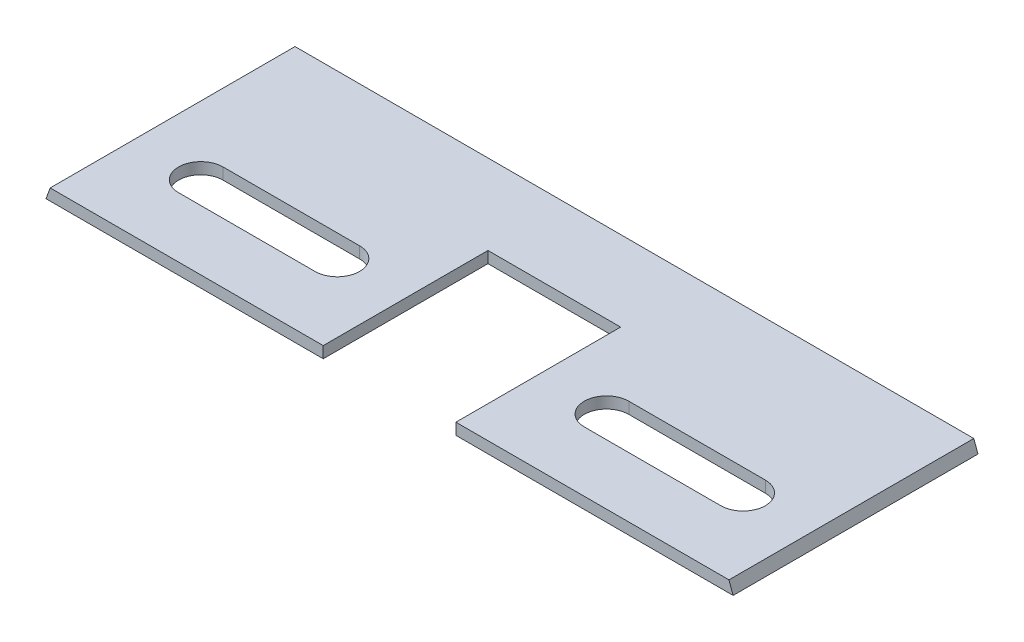
ISO-10303-21;
HEADER;
FILE_DESCRIPTION(('STEP AP214'),'2;1');
FILE_NAME('part.step','',(''),(''),'','','');
FILE_SCHEMA(('AUTOMOTIVE_DESIGN { 1 0 10303 214 1 1 1 1 }'));
ENDSEC;
DATA;
#1=APPLICATION_CONTEXT('core data for automotive mechanical design processes');
#2=APPLICATION_PROTOCOL_DEFINITION('international standard','automotive_design',2000,#1);
#3=PRODUCT_CONTEXT('',#1,'mechanical');
#4=PRODUCT('Part','Part','',(#3));
#5=PRODUCT_RELATED_PRODUCT_CATEGORY('part','',(#4));
#6=PRODUCT_DEFINITION_FORMATION('','',#4);
#7=PRODUCT_DEFINITION_CONTEXT('part definition',#1,'design');
#8=PRODUCT_DEFINITION('design','',#6,#7);
#9=PRODUCT_DEFINITION_SHAPE('','',#8);
#10=(LENGTH_UNIT() NAMED_UNIT(*) SI_UNIT(.MILLI.,.METRE.));
#11=(NAMED_UNIT(*) PLANE_ANGLE_UNIT() SI_UNIT($,.RADIAN.));
#12=(NAMED_UNIT(*) SI_UNIT($,.STERADIAN.) SOLID_ANGLE_UNIT());
#13=UNCERTAINTY_MEASURE_WITH_UNIT(LENGTH_MEASURE(1.E-05),#10,'distance_accuracy_value','');
#14=(GEOMETRIC_REPRESENTATION_CONTEXT(3) GLOBAL_UNCERTAINTY_ASSIGNED_CONTEXT((#13)) GLOBAL_UNIT_ASSIGNED_CONTEXT((#10,
#11,#12)) REPRESENTATION_CONTEXT('',''));
#15=CARTESIAN_POINT('',(0.,0.,0.));
#16=DIRECTION('',(0.,0.,1.));
#17=DIRECTION('',(1.,0.,0.));
#18=AXIS2_PLACEMENT_3D('',#15,#16,#17);
#19=CARTESIAN_POINT('',(0.,0.,0.));
#20=DIRECTION('',(0.,0.,-1.));
#21=DIRECTION('',(-1.,0.,0.));
#22=AXIS2_PLACEMENT_3D('',#19,#20,#21);
#23=PLANE('',#22);
#24=DIRECTION('',(1.,0.,0.));
#25=VECTOR('',#24,1.);
#26=CARTESIAN_POINT('',(-77.1690234282915,-1.28453893117885,0.));
#27=LINE('',#26,#25);
#28=CARTESIAN_POINT('',(-77.1690234282915,-1.28453893117885,0.));
#29=VERTEX_POINT('',#28);
#30=CARTESIAN_POINT('',(-14.9,-1.28453893117885,0.));
#31=VERTEX_POINT('',#30);
#32=EDGE_CURVE('E235',#29,#31,#27,.T.);
#33=ORIENTED_EDGE('',*,*,#32,.T.);
#34=DIRECTION('',(0.,1.,0.));
#35=VECTOR('',#34,1.);
#36=CARTESIAN_POINT('',(-14.9,0.,0.));
#37=LINE('',#36,#35);
#38=CARTESIAN_POINT('',(-14.9,1.28453893117886,0.));
#39=VERTEX_POINT('',#38);
#40=EDGE_CURVE('E257',#31,#39,#37,.T.);
#41=ORIENTED_EDGE('',*,*,#40,.T.);
#42=DIRECTION('',(-1.,0.,0.));
#43=VECTOR('',#42,1.);
#44=CARTESIAN_POINT('',(-76.233955556881,1.28453893117885,0.));
#45=LINE('',#44,#43);
#46=CARTESIAN_POINT('',(-76.233955556881,1.28453893117885,0.));
#47=VERTEX_POINT('',#46);
#48=EDGE_CURVE('E241',#39,#47,#45,.T.);
#49=ORIENTED_EDGE('',*,*,#48,.T.);
#50=DIRECTION('',(-0.342020143325681,-0.939692620785904,0.));
#51=VECTOR('',#50,1.);
#52=CARTESIAN_POINT('',(-76.2650768448035,1.19903389534744,0.));
#53=LINE('',#52,#51);
#54=EDGE_CURVE('E220',#47,#29,#53,.T.);
#55=ORIENTED_EDGE('',*,*,#54,.T.);
#56=EDGE_LOOP('',(#33,#41,#49,#55));
#57=FACE_BOUND('',#56,.T.);
#58=ADVANCED_FACE('F41',(#57),#23,.F.);
#59=CARTESIAN_POINT('',(-76.233955556881,1.28453893117885,-55.));
#60=DIRECTION('',(0.,1.,0.));
#61=DIRECTION('',(-1.,0.,0.));
#62=AXIS2_PLACEMENT_3D('',#59,#60,#61);
#63=PLANE('',#62);
#64=CARTESIAN_POINT('',(30.2334888892203,1.28453893117886,-18.5));
#65=DIRECTION('',(0.,1.,0.));
#66=DIRECTION('',(1.,0.,0.));
#67=AXIS2_PLACEMENT_3D('',#64,#65,#66);
#68=CIRCLE('',#67,5.);
#69=CARTESIAN_POINT('',(30.2334888892203,1.28453893117886,-23.5));
#70=VERTEX_POINT('',#69);
#71=CARTESIAN_POINT('',(30.2334888892203,1.28453893117886,-13.5));
#72=VERTEX_POINT('',#71);
#73=EDGE_CURVE('E56',#70,#72,#68,.T.);
#74=ORIENTED_EDGE('',*,*,#73,.F.);
#75=DIRECTION('',(-1.,0.,0.));
#76=VECTOR('',#75,1.);
#77=CARTESIAN_POINT('',(60.9004666676608,1.28453893117886,-23.5));
#78=LINE('',#77,#76);
#79=CARTESIAN_POINT('',(60.9004666676608,1.28453893117886,-23.5));
#80=VERTEX_POINT('',#79);
#81=EDGE_CURVE('E177',#80,#70,#78,.T.);
#82=ORIENTED_EDGE('',*,*,#81,.F.);
#83=CARTESIAN_POINT('',(60.9004666676608,1.28453893117886,-18.5));
#84=DIRECTION('',(0.,1.,0.));
#85=DIRECTION('',(1.,0.,0.));
#86=AXIS2_PLACEMENT_3D('',#83,#84,#85);
#87=CIRCLE('',#86,5.);
#88=CARTESIAN_POINT('',(60.9004666676608,1.28453893117886,-13.5));
#89=VERTEX_POINT('',#88);
#90=EDGE_CURVE('E160',#89,#80,#87,.T.);
#91=ORIENTED_EDGE('',*,*,#90,.F.);
#92=DIRECTION('',(1.,0.,0.));
#93=VECTOR('',#92,1.);
#94=CARTESIAN_POINT('',(60.9004666676608,1.28453893117886,-13.5));
#95=LINE('',#94,#93);
#96=EDGE_CURVE('E170',#72,#89,#95,.T.);
#97=ORIENTED_EDGE('',*,*,#96,.F.);
#98=EDGE_LOOP('',(#74,#82,#91,#97));
#99=FACE_BOUND('',#98,.T.);
#100=CARTESIAN_POINT('',(-60.9004666676608,1.28453893117886,-18.5));
#101=DIRECTION('',(0.,1.,0.));
#102=DIRECTION('',(-1.,0.,0.));
#103=AXIS2_PLACEMENT_3D('',#100,#101,#102);
#104=CIRCLE('',#103,5.);
#105=CARTESIAN_POINT('',(-60.9004666676608,1.28453893117886,-23.5));
#106=VERTEX_POINT('',#105);
#107=CARTESIAN_POINT('',(-60.9004666676608,1.28453893117886,-13.5));
#108=VERTEX_POINT('',#107);
#109=EDGE_CURVE('E64',#106,#108,#104,.T.);
#110=ORIENTED_EDGE('',*,*,#109,.F.);
#111=DIRECTION('',(-1.,0.,0.));
#112=VECTOR('',#111,1.);
#113=CARTESIAN_POINT('',(-60.9004666676608,1.28453893117886,-23.5));
#114=LINE('',#113,#112);
#115=CARTESIAN_POINT('',(-30.2334888892203,1.28453893117886,-23.5));
#116=VERTEX_POINT('',#115);
#117=EDGE_CURVE('E194',#116,#106,#114,.T.);
#118=ORIENTED_EDGE('',*,*,#117,.F.);
#119=CARTESIAN_POINT('',(-30.2334888892203,1.28453893117886,-18.5));
#120=DIRECTION('',(0.,1.,0.));
#121=DIRECTION('',(-1.,0.,0.));
#122=AXIS2_PLACEMENT_3D('',#119,#120,#121);
#123=CIRCLE('',#122,5.);
#124=CARTESIAN_POINT('',(-30.2334888892203,1.28453893117886,-13.5));
#125=VERTEX_POINT('',#124);
#126=EDGE_CURVE('E191',#125,#116,#123,.T.);
#127=ORIENTED_EDGE('',*,*,#126,.F.);
#128=DIRECTION('',(1.,0.,0.));
#129=VECTOR('',#128,1.);
#130=CARTESIAN_POINT('',(-60.9004666676608,1.28453893117886,-13.5));
#131=LINE('',#130,#129);
#132=EDGE_CURVE('E188',#108,#125,#131,.T.);
#133=ORIENTED_EDGE('',*,*,#132,.F.);
#134=EDGE_LOOP('',(#110,#118,#127,#133));
#135=FACE_BOUND('',#134,.T.);
#136=DIRECTION('',(0.,0.,1.));
#137=VECTOR('',#136,1.);
#138=CARTESIAN_POINT('',(-14.9,1.28453893117886,0.));
#139=LINE('',#138,#137);
#140=CARTESIAN_POINT('',(-14.9,1.28453893117886,-37.));
#141=VERTEX_POINT('',#140);
#142=EDGE_CURVE('E210',#141,#39,#139,.T.);
#143=ORIENTED_EDGE('',*,*,#142,.F.);
#144=DIRECTION('',(-1.,0.,0.));
#145=VECTOR('',#144,1.);
#146=CARTESIAN_POINT('',(-14.9,1.28453893117886,-37.));
#147=LINE('',#146,#145);
#148=CARTESIAN_POINT('',(14.9,1.28453893117886,-37.));
#149=VERTEX_POINT('',#148);
#150=EDGE_CURVE('E207',#149,#141,#147,.T.);
#151=ORIENTED_EDGE('',*,*,#150,.F.);
#152=DIRECTION('',(0.,0.,-1.));
#153=VECTOR('',#152,1.);
#154=CARTESIAN_POINT('',(14.9,1.28453893117886,-37.));
#155=LINE('',#154,#153);
#156=CARTESIAN_POINT('',(14.9,1.28453893117886,0.));
#157=VERTEX_POINT('',#156);
#158=EDGE_CURVE('E184',#157,#149,#155,.T.);
#159=ORIENTED_EDGE('',*,*,#158,.F.);
#160=CARTESIAN_POINT('',(76.233955556881,1.28453893117886,0.));
#161=VERTEX_POINT('',#160);
#162=EDGE_CURVE('E224',#161,#157,#45,.T.);
#163=ORIENTED_EDGE('',*,*,#162,.F.);
#164=DIRECTION('',(0.,0.,1.));
#165=VECTOR('',#164,1.);
#166=CARTESIAN_POINT('',(76.233955556881,1.28453893117886,-55.));
#167=LINE('',#166,#165);
#168=CARTESIAN_POINT('',(76.233955556881,1.28453893117886,-55.));
#169=VERTEX_POINT('',#168);
#170=EDGE_CURVE('E248',#169,#161,#167,.T.);
#171=ORIENTED_EDGE('',*,*,#170,.F.);
#172=DIRECTION('',(-1.,0.,0.));
#173=VECTOR('',#172,1.);
#174=CARTESIAN_POINT('',(76.233955556881,1.28453893117886,-55.));
#175=LINE('',#174,#173);
#176=CARTESIAN_POINT('',(-76.233955556881,1.28453893117885,-55.));
#177=VERTEX_POINT('',#176);
#178=EDGE_CURVE('E229',#169,#177,#175,.T.);
#179=ORIENTED_EDGE('',*,*,#178,.T.);
#180=DIRECTION('',(0.,0.,1.));
#181=VECTOR('',#180,1.);
#182=CARTESIAN_POINT('',(-76.233955556881,1.28453893117885,-55.));
#183=LINE('',#182,#181);
#184=EDGE_CURVE('E244',#177,#47,#183,.T.);
#185=ORIENTED_EDGE('',*,*,#184,.T.);
#186=ORIENTED_EDGE('',*,*,#48,.F.);
#187=EDGE_LOOP('',(#143,#151,#159,#163,#171,#179,#185,#186));
#188=FACE_BOUND('',#187,.T.);
#189=ADVANCED_FACE('F174',(#99,#135,#188),#63,.T.);
#190=CARTESIAN_POINT('',(76.2650768448035,1.19903389534744,-55.));
#191=DIRECTION('',(0.939692620785915,0.34202014332565,0.));
#192=DIRECTION('',(-0.34202014332565,0.939692620785915,0.));
#193=AXIS2_PLACEMENT_3D('',#190,#191,#192);
#194=PLANE('',#193);
#195=DIRECTION('',(-0.34202014332565,0.939692620785915,0.));
#196=VECTOR('',#195,1.);
#197=CARTESIAN_POINT('',(76.2650768448035,1.19903389534744,0.));
#198=LINE('',#197,#196);
#199=CARTESIAN_POINT('',(77.1690234282915,-1.28453893117885,0.));
#200=VERTEX_POINT('',#199);
#201=EDGE_CURVE('E238',#200,#161,#198,.T.);
#202=ORIENTED_EDGE('',*,*,#201,.F.);
#203=DIRECTION('',(0.,0.,1.));
#204=VECTOR('',#203,1.);
#205=CARTESIAN_POINT('',(77.1690234282915,-1.28453893117885,-55.));
#206=LINE('',#205,#204);
#207=CARTESIAN_POINT('',(77.1690234282915,-1.28453893117885,-55.));
#208=VERTEX_POINT('',#207);
#209=EDGE_CURVE('E251',#208,#200,#206,.T.);
#210=ORIENTED_EDGE('',*,*,#209,.F.);
#211=DIRECTION('',(-0.342020143325681,0.939692620785904,0.));
#212=VECTOR('',#211,1.);
#213=CARTESIAN_POINT('',(77.1690234282915,-1.28453893117885,-55.));
#214=LINE('',#213,#212);
#215=EDGE_CURVE('E227',#208,#169,#214,.T.);
#216=ORIENTED_EDGE('',*,*,#215,.T.);
#217=ORIENTED_EDGE('',*,*,#170,.T.);
#218=EDGE_LOOP('',(#202,#210,#216,#217));
#219=FACE_BOUND('',#218,.T.);
#220=ADVANCED_FACE('F302',(#219),#194,.T.);
#221=CARTESIAN_POINT('',(-77.1690234282915,-1.28453893117885,-55.));
#222=DIRECTION('',(0.,-1.,0.));
#223=DIRECTION('',(0.,0.,-1.));
#224=AXIS2_PLACEMENT_3D('',#221,#222,#223);
#225=PLANE('',#224);
#226=CARTESIAN_POINT('',(30.2334888892203,-1.28453893117885,-18.5));
#227=DIRECTION('',(0.,-1.,0.));
#228=DIRECTION('',(0.,0.,-1.));
#229=AXIS2_PLACEMENT_3D('',#226,#227,#228);
#230=CIRCLE('',#229,5.);
#231=CARTESIAN_POINT('',(30.2334888892203,-1.28453893117885,-13.5));
#232=VERTEX_POINT('',#231);
#233=CARTESIAN_POINT('',(30.2334888892203,-1.28453893117885,-23.5));
#234=VERTEX_POINT('',#233);
#235=EDGE_CURVE('E11',#232,#234,#230,.T.);
#236=ORIENTED_EDGE('',*,*,#235,.F.);
#237=DIRECTION('',(-1.,0.,0.));
#238=VECTOR('',#237,1.);
#239=CARTESIAN_POINT('',(-77.1690234282915,-1.28453893117885,-13.5));
#240=LINE('',#239,#238);
#241=CARTESIAN_POINT('',(60.9004666676608,-1.28453893117885,-13.5));
#242=VERTEX_POINT('',#241);
#243=EDGE_CURVE('E271',#242,#232,#240,.T.);
#244=ORIENTED_EDGE('',*,*,#243,.F.);
#245=CARTESIAN_POINT('',(60.9004666676608,-1.28453893117885,-18.5));
#246=DIRECTION('',(0.,-1.,0.));
#247=DIRECTION('',(0.,0.,-1.));
#248=AXIS2_PLACEMENT_3D('',#245,#246,#247);
#249=CIRCLE('',#248,5.);
#250=CARTESIAN_POINT('',(60.9004666676608,-1.28453893117885,-23.5));
#251=VERTEX_POINT('',#250);
#252=EDGE_CURVE('E163',#251,#242,#249,.T.);
#253=ORIENTED_EDGE('',*,*,#252,.F.);
#254=DIRECTION('',(1.,0.,0.));
#255=VECTOR('',#254,1.);
#256=CARTESIAN_POINT('',(-77.1690234282915,-1.28453893117885,-23.5));
#257=LINE('',#256,#255);
#258=EDGE_CURVE('E49',#234,#251,#257,.T.);
#259=ORIENTED_EDGE('',*,*,#258,.F.);
#260=EDGE_LOOP('',(#236,#244,#253,#259));
#261=FACE_BOUND('',#260,.T.);
#262=CARTESIAN_POINT('',(-60.9004666676608,-1.28453893117885,-18.5));
#263=DIRECTION('',(0.,-1.,0.));
#264=DIRECTION('',(0.,0.,-1.));
#265=AXIS2_PLACEMENT_3D('',#262,#263,#264);
#266=CIRCLE('',#265,5.);
#267=CARTESIAN_POINT('',(-60.9004666676608,-1.28453893117885,-13.5));
#268=VERTEX_POINT('',#267);
#269=CARTESIAN_POINT('',(-60.9004666676608,-1.28453893117885,-23.5));
#270=VERTEX_POINT('',#269);
#271=EDGE_CURVE('E269',#268,#270,#266,.T.);
#272=ORIENTED_EDGE('',*,*,#271,.F.);
#273=DIRECTION('',(-1.,0.,0.));
#274=VECTOR('',#273,1.);
#275=CARTESIAN_POINT('',(-77.1690234282915,-1.28453893117885,-13.5));
#276=LINE('',#275,#274);
#277=CARTESIAN_POINT('',(-30.2334888892203,-1.28453893117885,-13.5));
#278=VERTEX_POINT('',#277);
#279=EDGE_CURVE('E262',#278,#268,#276,.T.);
#280=ORIENTED_EDGE('',*,*,#279,.F.);
#281=CARTESIAN_POINT('',(-30.2334888892203,-1.28453893117885,-18.5));
#282=DIRECTION('',(0.,-1.,0.));
#283=DIRECTION('',(0.,0.,-1.));
#284=AXIS2_PLACEMENT_3D('',#281,#282,#283);
#285=CIRCLE('',#284,5.);
#286=CARTESIAN_POINT('',(-30.2334888892203,-1.28453893117885,-23.5));
#287=VERTEX_POINT('',#286);
#288=EDGE_CURVE('E264',#287,#278,#285,.T.);
#289=ORIENTED_EDGE('',*,*,#288,.F.);
#290=DIRECTION('',(1.,0.,0.));
#291=VECTOR('',#290,1.);
#292=CARTESIAN_POINT('',(-77.1690234282915,-1.28453893117885,-23.5));
#293=LINE('',#292,#291);
#294=EDGE_CURVE('E267',#270,#287,#293,.T.);
#295=ORIENTED_EDGE('',*,*,#294,.F.);
#296=EDGE_LOOP('',(#272,#280,#289,#295));
#297=FACE_BOUND('',#296,.T.);
#298=DIRECTION('',(0.,0.,-1.));
#299=VECTOR('',#298,1.);
#300=CARTESIAN_POINT('',(-14.9,-1.28453893117885,-55.));
#301=LINE('',#300,#299);
#302=CARTESIAN_POINT('',(-14.9,-1.28453893117885,-37.));
#303=VERTEX_POINT('',#302);
#304=EDGE_CURVE('E218',#31,#303,#301,.T.);
#305=ORIENTED_EDGE('',*,*,#304,.F.);
#306=ORIENTED_EDGE('',*,*,#32,.F.);
#307=DIRECTION('',(0.,0.,1.));
#308=VECTOR('',#307,1.);
#309=CARTESIAN_POINT('',(-77.1690234282915,-1.28453893117885,-55.));
#310=LINE('',#309,#308);
#311=CARTESIAN_POINT('',(-77.1690234282915,-1.28453893117885,-55.));
#312=VERTEX_POINT('',#311);
#313=EDGE_CURVE('E231',#312,#29,#310,.T.);
#314=ORIENTED_EDGE('',*,*,#313,.F.);
#315=DIRECTION('',(1.,0.,0.));
#316=VECTOR('',#315,1.);
#317=CARTESIAN_POINT('',(-77.1690234282915,-1.28453893117885,-55.));
#318=LINE('',#317,#316);
#319=EDGE_CURVE('E223',#312,#208,#318,.T.);
#320=ORIENTED_EDGE('',*,*,#319,.T.);
#321=ORIENTED_EDGE('',*,*,#209,.T.);
#322=CARTESIAN_POINT('',(14.9,-1.28453893117885,0.));
#323=VERTEX_POINT('',#322);
#324=EDGE_CURVE('E234',#323,#200,#27,.T.);
#325=ORIENTED_EDGE('',*,*,#324,.F.);
#326=DIRECTION('',(0.,0.,1.));
#327=VECTOR('',#326,1.);
#328=CARTESIAN_POINT('',(14.9,-1.28453893117885,-55.));
#329=LINE('',#328,#327);
#330=CARTESIAN_POINT('',(14.9,-1.28453893117885,-37.));
#331=VERTEX_POINT('',#330);
#332=EDGE_CURVE('E215',#331,#323,#329,.T.);
#333=ORIENTED_EDGE('',*,*,#332,.F.);
#334=DIRECTION('',(1.,0.,0.));
#335=VECTOR('',#334,1.);
#336=CARTESIAN_POINT('',(-77.1690234282915,-1.28453893117885,-37.));
#337=LINE('',#336,#335);
#338=EDGE_CURVE('E260',#303,#331,#337,.T.);
#339=ORIENTED_EDGE('',*,*,#338,.F.);
#340=EDGE_LOOP('',(#305,#306,#314,#320,#321,#325,#333,#339));
#341=FACE_BOUND('',#340,.T.);
#342=ADVANCED_FACE('F279',(#261,#297,#341),#225,.T.);
#343=CARTESIAN_POINT('',(-76.2650768448035,1.19903389534744,-55.));
#344=DIRECTION('',(-0.939692620785904,0.342020143325681,0.));
#345=DIRECTION('',(-0.342020143325681,-0.939692620785904,0.));
#346=AXIS2_PLACEMENT_3D('',#343,#344,#345);
#347=PLANE('',#346);
#348=ORIENTED_EDGE('',*,*,#54,.F.);
#349=ORIENTED_EDGE('',*,*,#184,.F.);
#350=DIRECTION('',(-0.342020143325662,-0.939692620785911,0.));
#351=VECTOR('',#350,1.);
#352=CARTESIAN_POINT('',(-76.2650768448035,1.19903389534744,-55.));
#353=LINE('',#352,#351);
#354=EDGE_CURVE('E221',#177,#312,#353,.T.);
#355=ORIENTED_EDGE('',*,*,#354,.T.);
#356=ORIENTED_EDGE('',*,*,#313,.T.);
#357=EDGE_LOOP('',(#348,#349,#355,#356));
#358=FACE_BOUND('',#357,.T.);
#359=ADVANCED_FACE('F43',(#358),#347,.T.);
#360=CARTESIAN_POINT('',(0.,0.,-55.));
#361=DIRECTION('',(0.,0.,-1.));
#362=DIRECTION('',(-1.,0.,0.));
#363=AXIS2_PLACEMENT_3D('',#360,#361,#362);
#364=PLANE('',#363);
#365=ORIENTED_EDGE('',*,*,#354,.F.);
#366=ORIENTED_EDGE('',*,*,#178,.F.);
#367=ORIENTED_EDGE('',*,*,#215,.F.);
#368=ORIENTED_EDGE('',*,*,#319,.F.);
#369=EDGE_LOOP('',(#365,#366,#367,#368));
#370=FACE_BOUND('',#369,.T.);
#371=ADVANCED_FACE('F307',(#370),#364,.T.);
#372=ORIENTED_EDGE('',*,*,#162,.T.);
#373=DIRECTION('',(0.,-1.,0.));
#374=VECTOR('',#373,1.);
#375=CARTESIAN_POINT('',(14.9,0.,0.));
#376=LINE('',#375,#374);
#377=EDGE_CURVE('E247',#157,#323,#376,.T.);
#378=ORIENTED_EDGE('',*,*,#377,.T.);
#379=ORIENTED_EDGE('',*,*,#324,.T.);
#380=ORIENTED_EDGE('',*,*,#201,.T.);
#381=EDGE_LOOP('',(#372,#378,#379,#380));
#382=FACE_BOUND('',#381,.T.);
#383=ADVANCED_FACE('F298',(#382),#23,.F.);
#384=CARTESIAN_POINT('',(-14.9,-1.71546106882113,0.));
#385=DIRECTION('',(-1.,0.,0.));
#386=DIRECTION('',(0.,-1.,0.));
#387=AXIS2_PLACEMENT_3D('',#384,#385,#386);
#388=PLANE('',#387);
#389=ORIENTED_EDGE('',*,*,#304,.T.);
#390=DIRECTION('',(0.,1.,0.));
#391=VECTOR('',#390,1.);
#392=CARTESIAN_POINT('',(-14.9,-1.71546106882113,-37.));
#393=LINE('',#392,#391);
#394=EDGE_CURVE('E213',#303,#141,#393,.T.);
#395=ORIENTED_EDGE('',*,*,#394,.T.);
#396=ORIENTED_EDGE('',*,*,#142,.T.);
#397=ORIENTED_EDGE('',*,*,#40,.F.);
#398=EDGE_LOOP('',(#389,#395,#396,#397));
#399=FACE_BOUND('',#398,.T.);
#400=ADVANCED_FACE('F306',(#399),#388,.F.);
#401=CARTESIAN_POINT('',(-14.9,-1.71546106882113,-37.));
#402=DIRECTION('',(0.,0.,-1.));
#403=DIRECTION('',(-1.,0.,0.));
#404=AXIS2_PLACEMENT_3D('',#401,#402,#403);
#405=PLANE('',#404);
#406=ORIENTED_EDGE('',*,*,#338,.T.);
#407=DIRECTION('',(0.,1.,0.));
#408=VECTOR('',#407,1.);
#409=CARTESIAN_POINT('',(14.9,-1.71546106882113,-37.));
#410=LINE('',#409,#408);
#411=EDGE_CURVE('E212',#331,#149,#410,.T.);
#412=ORIENTED_EDGE('',*,*,#411,.T.);
#413=ORIENTED_EDGE('',*,*,#150,.T.);
#414=ORIENTED_EDGE('',*,*,#394,.F.);
#415=EDGE_LOOP('',(#406,#412,#413,#414));
#416=FACE_BOUND('',#415,.T.);
#417=ADVANCED_FACE('F313',(#416),#405,.F.);
#418=CARTESIAN_POINT('',(14.9,-1.71546106882113,-37.));
#419=DIRECTION('',(1.,0.,0.));
#420=DIRECTION('',(0.,0.,-1.));
#421=AXIS2_PLACEMENT_3D('',#418,#419,#420);
#422=PLANE('',#421);
#423=ORIENTED_EDGE('',*,*,#332,.T.);
#424=ORIENTED_EDGE('',*,*,#377,.F.);
#425=ORIENTED_EDGE('',*,*,#158,.T.);
#426=ORIENTED_EDGE('',*,*,#411,.F.);
#427=EDGE_LOOP('',(#423,#424,#425,#426));
#428=FACE_BOUND('',#427,.T.);
#429=ADVANCED_FACE('F343',(#428),#422,.F.);
#430=CARTESIAN_POINT('',(-60.9004666676608,-1.71546106882114,-18.5));
#431=DIRECTION('',(0.,1.,0.));
#432=DIRECTION('',(-1.,0.,0.));
#433=AXIS2_PLACEMENT_3D('',#430,#431,#432);
#434=CYLINDRICAL_SURFACE('',#433,5.);
#435=ORIENTED_EDGE('',*,*,#271,.T.);
#436=DIRECTION('',(0.,1.,0.));
#437=VECTOR('',#436,1.);
#438=CARTESIAN_POINT('',(-60.9004666676608,-1.71546106882114,-23.5));
#439=LINE('',#438,#437);
#440=EDGE_CURVE('E198',#270,#106,#439,.T.);
#441=ORIENTED_EDGE('',*,*,#440,.T.);
#442=ORIENTED_EDGE('',*,*,#109,.T.);
#443=DIRECTION('',(0.,1.,0.));
#444=VECTOR('',#443,1.);
#445=CARTESIAN_POINT('',(-60.9004666676608,-1.71546106882114,-13.5));
#446=LINE('',#445,#444);
#447=EDGE_CURVE('E197',#268,#108,#446,.T.);
#448=ORIENTED_EDGE('',*,*,#447,.F.);
#449=EDGE_LOOP('',(#435,#441,#442,#448));
#450=FACE_BOUND('',#449,.T.);
#451=ADVANCED_FACE('F345',(#450),#434,.F.);
#452=CARTESIAN_POINT('',(-60.9004666676608,-1.71546106882114,-23.5));
#453=DIRECTION('',(0.,0.,-1.));
#454=DIRECTION('',(-1.,0.,0.));
#455=AXIS2_PLACEMENT_3D('',#452,#453,#454);
#456=PLANE('',#455);
#457=ORIENTED_EDGE('',*,*,#294,.T.);
#458=DIRECTION('',(0.,1.,0.));
#459=VECTOR('',#458,1.);
#460=CARTESIAN_POINT('',(-30.2334888892203,-1.71546106882114,-23.5));
#461=LINE('',#460,#459);
#462=EDGE_CURVE('E200',#287,#116,#461,.T.);
#463=ORIENTED_EDGE('',*,*,#462,.T.);
#464=ORIENTED_EDGE('',*,*,#117,.T.);
#465=ORIENTED_EDGE('',*,*,#440,.F.);
#466=EDGE_LOOP('',(#457,#463,#464,#465));
#467=FACE_BOUND('',#466,.T.);
#468=ADVANCED_FACE('F351',(#467),#456,.F.);
#469=CARTESIAN_POINT('',(-30.2334888892203,-1.71546106882114,-18.5));
#470=DIRECTION('',(0.,1.,0.));
#471=DIRECTION('',(-1.,0.,0.));
#472=AXIS2_PLACEMENT_3D('',#469,#470,#471);
#473=CYLINDRICAL_SURFACE('',#472,5.);
#474=ORIENTED_EDGE('',*,*,#288,.T.);
#475=DIRECTION('',(0.,1.,0.));
#476=VECTOR('',#475,1.);
#477=CARTESIAN_POINT('',(-30.2334888892203,-1.71546106882114,-13.5));
#478=LINE('',#477,#476);
#479=EDGE_CURVE('E202',#278,#125,#478,.T.);
#480=ORIENTED_EDGE('',*,*,#479,.T.);
#481=ORIENTED_EDGE('',*,*,#126,.T.);
#482=ORIENTED_EDGE('',*,*,#462,.F.);
#483=EDGE_LOOP('',(#474,#480,#481,#482));
#484=FACE_BOUND('',#483,.T.);
#485=ADVANCED_FACE('F290',(#484),#473,.F.);
#486=CARTESIAN_POINT('',(-60.9004666676608,-1.71546106882114,-13.5));
#487=DIRECTION('',(0.,0.,1.));
#488=DIRECTION('',(1.,0.,0.));
#489=AXIS2_PLACEMENT_3D('',#486,#487,#488);
#490=PLANE('',#489);
#491=ORIENTED_EDGE('',*,*,#279,.T.);
#492=ORIENTED_EDGE('',*,*,#447,.T.);
#493=ORIENTED_EDGE('',*,*,#132,.T.);
#494=ORIENTED_EDGE('',*,*,#479,.F.);
#495=EDGE_LOOP('',(#491,#492,#493,#494));
#496=FACE_BOUND('',#495,.T.);
#497=ADVANCED_FACE('F283',(#496),#490,.F.);
#498=CARTESIAN_POINT('',(30.2334888892203,-1.71546106882114,-18.5));
#499=DIRECTION('',(0.,1.,0.));
#500=DIRECTION('',(-1.,0.,0.));
#501=AXIS2_PLACEMENT_3D('',#498,#499,#500);
#502=CYLINDRICAL_SURFACE('',#501,5.);
#503=ORIENTED_EDGE('',*,*,#235,.T.);
#504=DIRECTION('',(0.,1.,0.));
#505=VECTOR('',#504,1.);
#506=CARTESIAN_POINT('',(30.2334888892203,-1.71546106882114,-23.5));
#507=LINE('',#506,#505);
#508=EDGE_CURVE('E182',#234,#70,#507,.T.);
#509=ORIENTED_EDGE('',*,*,#508,.T.);
#510=ORIENTED_EDGE('',*,*,#73,.T.);
#511=DIRECTION('',(0.,1.,0.));
#512=VECTOR('',#511,1.);
#513=CARTESIAN_POINT('',(30.2334888892203,-1.71546106882114,-13.5));
#514=LINE('',#513,#512);
#515=EDGE_CURVE('E167',#232,#72,#514,.T.);
#516=ORIENTED_EDGE('',*,*,#515,.F.);
#517=EDGE_LOOP('',(#503,#509,#510,#516));
#518=FACE_BOUND('',#517,.T.);
#519=ADVANCED_FACE('F281',(#518),#502,.F.);
#520=CARTESIAN_POINT('',(60.9004666676608,-1.71546106882114,-23.5));
#521=DIRECTION('',(0.,0.,-1.));
#522=DIRECTION('',(-1.,0.,0.));
#523=AXIS2_PLACEMENT_3D('',#520,#521,#522);
#524=PLANE('',#523);
#525=ORIENTED_EDGE('',*,*,#258,.T.);
#526=DIRECTION('',(0.,1.,0.));
#527=VECTOR('',#526,1.);
#528=CARTESIAN_POINT('',(60.9004666676608,-1.71546106882114,-23.5));
#529=LINE('',#528,#527);
#530=EDGE_CURVE('E166',#251,#80,#529,.T.);
#531=ORIENTED_EDGE('',*,*,#530,.T.);
#532=ORIENTED_EDGE('',*,*,#81,.T.);
#533=ORIENTED_EDGE('',*,*,#508,.F.);
#534=EDGE_LOOP('',(#525,#531,#532,#533));
#535=FACE_BOUND('',#534,.T.);
#536=ADVANCED_FACE('F276',(#535),#524,.F.);
#537=CARTESIAN_POINT('',(60.9004666676608,-1.71546106882114,-18.5));
#538=DIRECTION('',(0.,1.,0.));
#539=DIRECTION('',(-1.,0.,0.));
#540=AXIS2_PLACEMENT_3D('',#537,#538,#539);
#541=CYLINDRICAL_SURFACE('',#540,5.);
#542=ORIENTED_EDGE('',*,*,#252,.T.);
#543=DIRECTION('',(0.,1.,0.));
#544=VECTOR('',#543,1.);
#545=CARTESIAN_POINT('',(60.9004666676608,-1.71546106882114,-13.5));
#546=LINE('',#545,#544);
#547=EDGE_CURVE('E155',#242,#89,#546,.T.);
#548=ORIENTED_EDGE('',*,*,#547,.T.);
#549=ORIENTED_EDGE('',*,*,#90,.T.);
#550=ORIENTED_EDGE('',*,*,#530,.F.);
#551=EDGE_LOOP('',(#542,#548,#549,#550));
#552=FACE_BOUND('',#551,.T.);
#553=ADVANCED_FACE('F157',(#552),#541,.F.);
#554=CARTESIAN_POINT('',(60.9004666676608,-1.71546106882114,-13.5));
#555=DIRECTION('',(0.,0.,1.));
#556=DIRECTION('',(1.,0.,0.));
#557=AXIS2_PLACEMENT_3D('',#554,#555,#556);
#558=PLANE('',#557);
#559=ORIENTED_EDGE('',*,*,#243,.T.);
#560=ORIENTED_EDGE('',*,*,#515,.T.);
#561=ORIENTED_EDGE('',*,*,#96,.T.);
#562=ORIENTED_EDGE('',*,*,#547,.F.);
#563=EDGE_LOOP('',(#559,#560,#561,#562));
#564=FACE_BOUND('',#563,.T.);
#565=ADVANCED_FACE('F171',(#564),#558,.F.);
#566=CLOSED_SHELL('',(#58,#189,#220,#342,#359,#371,#383,#400,#417,#429,#451,#468,#485,#497,#519,
#536,#553,#565));
#567=MANIFOLD_SOLID_BREP('B2',#566);
#568=ADVANCED_BREP_SHAPE_REPRESENTATION('',(#18,#567),#14);
#569=SHAPE_DEFINITION_REPRESENTATION(#9,#568);
ENDSEC;
END-ISO-10303-21;
